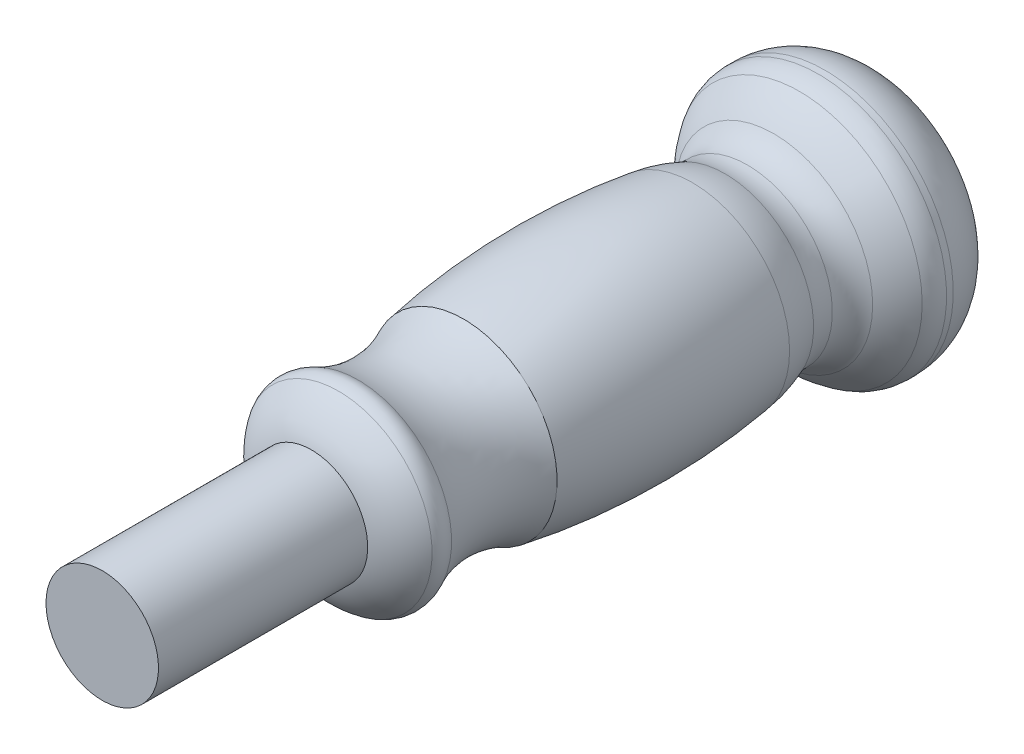
ISO-10303-21;
HEADER;
FILE_DESCRIPTION(('STEP AP214'),'2;1');
FILE_NAME('part.step','',(''),(''),'','','');
FILE_SCHEMA(('AUTOMOTIVE_DESIGN { 1 0 10303 214 1 1 1 1 }'));
ENDSEC;
DATA;
#1=APPLICATION_CONTEXT('core data for automotive mechanical design processes');
#2=APPLICATION_PROTOCOL_DEFINITION('international standard','automotive_design',2000,#1);
#3=PRODUCT_CONTEXT('',#1,'mechanical');
#4=PRODUCT('Part','Part','',(#3));
#5=PRODUCT_RELATED_PRODUCT_CATEGORY('part','',(#4));
#6=PRODUCT_DEFINITION_FORMATION('','',#4);
#7=PRODUCT_DEFINITION_CONTEXT('part definition',#1,'design');
#8=PRODUCT_DEFINITION('design','',#6,#7);
#9=PRODUCT_DEFINITION_SHAPE('','',#8);
#10=(LENGTH_UNIT() NAMED_UNIT(*) SI_UNIT(.MILLI.,.METRE.));
#11=(NAMED_UNIT(*) PLANE_ANGLE_UNIT() SI_UNIT($,.RADIAN.));
#12=(NAMED_UNIT(*) SI_UNIT($,.STERADIAN.) SOLID_ANGLE_UNIT());
#13=UNCERTAINTY_MEASURE_WITH_UNIT(LENGTH_MEASURE(1.E-05),#10,'distance_accuracy_value','');
#14=(GEOMETRIC_REPRESENTATION_CONTEXT(3) GLOBAL_UNCERTAINTY_ASSIGNED_CONTEXT((#13)) GLOBAL_UNIT_ASSIGNED_CONTEXT((#10,
#11,#12)) REPRESENTATION_CONTEXT('',''));
#15=CARTESIAN_POINT('',(0.,0.,0.));
#16=DIRECTION('',(0.,0.,1.));
#17=DIRECTION('',(1.,0.,0.));
#18=AXIS2_PLACEMENT_3D('',#15,#16,#17);
#19=CARTESIAN_POINT('',(0.,0.,-152.4));
#20=DIRECTION('',(0.,0.,-1.));
#21=DIRECTION('',(-1.,0.,0.));
#22=AXIS2_PLACEMENT_3D('',#19,#20,#21);
#23=CYLINDRICAL_SURFACE('',#22,10.922);
#24=CARTESIAN_POINT('',(0.,0.,0.));
#25=DIRECTION('',(0.,0.,-1.));
#26=DIRECTION('',(-1.,0.,0.));
#27=AXIS2_PLACEMENT_3D('',#24,#25,#26);
#28=CIRCLE('',#27,10.922);
#29=CARTESIAN_POINT('',(-10.922,0.,0.));
#30=VERTEX_POINT('',#29);
#31=EDGE_CURVE('E74',#30,#30,#28,.T.);
#32=ORIENTED_EDGE('',*,*,#31,.T.);
#33=EDGE_LOOP('',(#32));
#34=FACE_BOUND('',#33,.T.);
#35=CARTESIAN_POINT('',(0.,0.,-40.64));
#36=DIRECTION('',(0.,0.,-1.));
#37=DIRECTION('',(-1.,0.,0.));
#38=AXIS2_PLACEMENT_3D('',#35,#36,#37);
#39=CIRCLE('',#38,10.922);
#40=CARTESIAN_POINT('',(-10.922,0.,-40.64));
#41=VERTEX_POINT('',#40);
#42=EDGE_CURVE('E10',#41,#41,#39,.T.);
#43=ORIENTED_EDGE('',*,*,#42,.F.);
#44=EDGE_LOOP('',(#43));
#45=FACE_BOUND('',#44,.T.);
#46=ADVANCED_FACE('F31',(#34,#45),#23,.T.);
#47=CARTESIAN_POINT('',(0.,0.,-53.7343067267956));
#48=DIRECTION('',(0.,0.,-1.));
#49=DIRECTION('',(-1.,0.,0.));
#50=AXIS2_PLACEMENT_3D('',#47,#48,#49);
#51=DEGENERATE_TOROIDAL_SURFACE('',#50,6.88592212427021,13.7022185530066,.T.);
#52=ORIENTED_EDGE('',*,*,#42,.T.);
#53=EDGE_LOOP('',(#52));
#54=FACE_BOUND('',#53,.T.);
#55=CARTESIAN_POINT('',(0.,0.,-45.9269732436232));
#56=DIRECTION('',(0.,0.,-1.));
#57=DIRECTION('',(-1.,0.,0.));
#58=AXIS2_PLACEMENT_3D('',#55,#56,#57);
#59=CIRCLE('',#58,18.1463100908056);
#60=CARTESIAN_POINT('',(-18.1463100908056,0.,-45.9269732436232));
#61=VERTEX_POINT('',#60);
#62=EDGE_CURVE('E37',#61,#61,#59,.T.);
#63=ORIENTED_EDGE('',*,*,#62,.F.);
#64=EDGE_LOOP('',(#63));
#65=FACE_BOUND('',#64,.T.);
#66=ADVANCED_FACE('F91',(#54,#65),#51,.T.);
#67=CARTESIAN_POINT('',(0.,0.,-47.8212488907953));
#68=DIRECTION('',(0.,0.,-1.));
#69=DIRECTION('',(-1.,0.,0.));
#70=AXIS2_PLACEMENT_3D('',#67,#68,#69);
#71=TOROIDAL_SURFACE('',#70,15.0438953815722,3.63500443679744);
#72=ORIENTED_EDGE('',*,*,#62,.T.);
#73=EDGE_LOOP('',(#72));
#74=FACE_BOUND('',#73,.T.);
#75=CARTESIAN_POINT('',(0.,0.,-49.7155245379673));
#76=DIRECTION('',(0.,0.,-1.));
#77=DIRECTION('',(-1.,0.,0.));
#78=AXIS2_PLACEMENT_3D('',#75,#76,#77);
#79=CIRCLE('',#78,18.1463100908056);
#80=CARTESIAN_POINT('',(-18.1463100908056,0.,-49.7155245379673));
#81=VERTEX_POINT('',#80);
#82=EDGE_CURVE('E41',#81,#81,#79,.T.);
#83=ORIENTED_EDGE('',*,*,#82,.F.);
#84=EDGE_LOOP('',(#83));
#85=FACE_BOUND('',#84,.T.);
#86=ADVANCED_FACE('F95',(#74,#85),#71,.T.);
#87=CARTESIAN_POINT('',(0.,0.,-59.9575181328046));
#88=DIRECTION('',(0.,0.,-1.));
#89=DIRECTION('',(-1.,0.,0.));
#90=AXIS2_PLACEMENT_3D('',#87,#88,#89);
#91=TOROIDAL_SURFACE('',#90,39.1447821976964,23.3630961907997);
#92=ORIENTED_EDGE('',*,*,#82,.T.);
#93=EDGE_LOOP('',(#92));
#94=FACE_BOUND('',#93,.T.);
#95=CARTESIAN_POINT('',(0.,0.,-70.1995117276419));
#96=DIRECTION('',(0.,0.,-1.));
#97=DIRECTION('',(-1.,0.,0.));
#98=AXIS2_PLACEMENT_3D('',#95,#96,#97);
#99=CIRCLE('',#98,18.1463100908056);
#100=CARTESIAN_POINT('',(-18.1463100908056,0.,-70.1995117276419));
#101=VERTEX_POINT('',#100);
#102=EDGE_CURVE('E45',#101,#101,#99,.T.);
#103=ORIENTED_EDGE('',*,*,#102,.F.);
#104=EDGE_LOOP('',(#103));
#105=FACE_BOUND('',#104,.T.);
#106=ADVANCED_FACE('F99',(#94,#105),#91,.F.);
#107=CARTESIAN_POINT('',(0.,0.,-94.6645510527242));
#108=DIRECTION('',(0.,0.,-1.));
#109=DIRECTION('',(-1.,0.,0.));
#110=AXIS2_PLACEMENT_3D('',#107,#108,#109);
#111=DEGENERATE_TOROIDAL_SURFACE('',#110,123.464948961464,143.709035344153,.F.);
#112=ORIENTED_EDGE('',*,*,#102,.T.);
#113=EDGE_LOOP('',(#112));
#114=FACE_BOUND('',#113,.T.);
#115=CARTESIAN_POINT('',(0.,0.,-114.664007691683));
#116=DIRECTION('',(0.,0.,-1.));
#117=DIRECTION('',(-1.,0.,0.));
#118=AXIS2_PLACEMENT_3D('',#115,#116,#117);
#119=CIRCLE('',#118,18.845657016071);
#120=CARTESIAN_POINT('',(-18.845657016071,0.,-114.664007691683));
#121=VERTEX_POINT('',#120);
#122=EDGE_CURVE('E50',#121,#121,#119,.T.);
#123=ORIENTED_EDGE('',*,*,#122,.F.);
#124=EDGE_LOOP('',(#123));
#125=FACE_BOUND('',#124,.T.);
#126=ADVANCED_FACE('F105',(#114,#125),#111,.F.);
#127=CARTESIAN_POINT('',(0.,0.,-110.793160163222));
#128=DIRECTION('',(0.,0.,-1.));
#129=DIRECTION('',(-1.,0.,0.));
#130=AXIS2_PLACEMENT_3D('',#127,#128,#129);
#131=DEGENERATE_TOROIDAL_SURFACE('',#130,8.69822416862676,27.8145438809509,.F.);
#132=ORIENTED_EDGE('',*,*,#122,.T.);
#133=EDGE_LOOP('',(#132));
#134=FACE_BOUND('',#133,.T.);
#135=CARTESIAN_POINT('',(0.,0.,-120.991679599425));
#136=DIRECTION('',(0.,0.,-1.));
#137=DIRECTION('',(-1.,0.,0.));
#138=AXIS2_PLACEMENT_3D('',#135,#136,#137);
#139=CIRCLE('',#138,17.17916079614);
#140=CARTESIAN_POINT('',(-17.17916079614,0.,-120.991679599425));
#141=VERTEX_POINT('',#140);
#142=EDGE_CURVE('E53',#141,#141,#139,.T.);
#143=ORIENTED_EDGE('',*,*,#142,.F.);
#144=EDGE_LOOP('',(#143));
#145=FACE_BOUND('',#144,.T.);
#146=ADVANCED_FACE('F109',(#134,#145),#131,.F.);
#147=CARTESIAN_POINT('',(0.,0.,-124.710703557818));
#148=DIRECTION('',(0.,0.,-1.));
#149=DIRECTION('',(-1.,0.,0.));
#150=AXIS2_PLACEMENT_3D('',#147,#148,#149);
#151=TOROIDAL_SURFACE('',#150,26.6156888398974,10.1429384659339);
#152=ORIENTED_EDGE('',*,*,#142,.T.);
#153=EDGE_LOOP('',(#152));
#154=FACE_BOUND('',#153,.T.);
#155=CARTESIAN_POINT('',(0.,0.,-125.328837200299));
#156=DIRECTION('',(0.,0.,-1.));
#157=DIRECTION('',(-1.,0.,0.));
#158=AXIS2_PLACEMENT_3D('',#155,#156,#157);
#159=CIRCLE('',#158,16.491603126918);
#160=CARTESIAN_POINT('',(-16.491603126918,0.,-125.328837200299));
#161=VERTEX_POINT('',#160);
#162=EDGE_CURVE('E56',#161,#161,#159,.T.);
#163=ORIENTED_EDGE('',*,*,#162,.F.);
#164=EDGE_LOOP('',(#163));
#165=FACE_BOUND('',#164,.T.);
#166=ADVANCED_FACE('F113',(#154,#165),#151,.F.);
#167=CARTESIAN_POINT('',(0.,0.,-124.903332351948));
#168=DIRECTION('',(0.,0.,-1.));
#169=DIRECTION('',(-1.,0.,0.));
#170=AXIS2_PLACEMENT_3D('',#167,#168,#169);
#171=TOROIDAL_SURFACE('',#170,23.4607231681825,6.98209771669844);
#172=ORIENTED_EDGE('',*,*,#162,.T.);
#173=EDGE_LOOP('',(#172));
#174=FACE_BOUND('',#173,.T.);
#175=CARTESIAN_POINT('',(0.,0.,-130.439683109815));
#176=DIRECTION('',(0.,0.,-1.));
#177=DIRECTION('',(-1.,0.,0.));
#178=AXIS2_PLACEMENT_3D('',#175,#176,#177);
#179=CIRCLE('',#178,19.2064889466812);
#180=CARTESIAN_POINT('',(-19.2064889466812,0.,-130.439683109815));
#181=VERTEX_POINT('',#180);
#182=EDGE_CURVE('E59',#181,#181,#179,.T.);
#183=ORIENTED_EDGE('',*,*,#182,.F.);
#184=EDGE_LOOP('',(#183));
#185=FACE_BOUND('',#184,.T.);
#186=ADVANCED_FACE('F117',(#174,#185),#171,.F.);
#187=CARTESIAN_POINT('',(0.,0.,-146.390686313675));
#188=DIRECTION('',(0.,0.,-1.));
#189=DIRECTION('',(-1.,0.,0.));
#190=AXIS2_PLACEMENT_3D('',#187,#188,#189);
#191=DEGENERATE_TOROIDAL_SURFACE('',#190,6.94944334661404,20.1164030097753,.T.);
#192=ORIENTED_EDGE('',*,*,#182,.T.);
#193=EDGE_LOOP('',(#192));
#194=FACE_BOUND('',#193,.T.);
#195=CARTESIAN_POINT('',(0.,0.,-135.437827897881));
#196=DIRECTION('',(0.,0.,-1.));
#197=DIRECTION('',(-1.,0.,0.));
#198=AXIS2_PLACEMENT_3D('',#195,#196,#197);
#199=CIRCLE('',#198,23.8226339925841);
#200=CARTESIAN_POINT('',(-23.8226339925841,0.,-135.437827897881));
#201=VERTEX_POINT('',#200);
#202=EDGE_CURVE('E62',#201,#201,#199,.T.);
#203=ORIENTED_EDGE('',*,*,#202,.F.);
#204=EDGE_LOOP('',(#203));
#205=FACE_BOUND('',#204,.T.);
#206=ADVANCED_FACE('F121',(#194,#205),#191,.T.);
#207=CARTESIAN_POINT('',(0.,0.,-139.097981176091));
#208=DIRECTION('',(0.,0.,-1.));
#209=DIRECTION('',(-1.,0.,0.));
#210=AXIS2_PLACEMENT_3D('',#207,#208,#209);
#211=TOROIDAL_SURFACE('',#210,18.1840635197235,6.72236558046447);
#212=ORIENTED_EDGE('',*,*,#202,.T.);
#213=EDGE_LOOP('',(#212));
#214=FACE_BOUND('',#213,.T.);
#215=CARTESIAN_POINT('',(0.,0.,-139.097981176091));
#216=DIRECTION('',(0.,0.,-1.));
#217=DIRECTION('',(-1.,0.,0.));
#218=AXIS2_PLACEMENT_3D('',#215,#216,#217);
#219=CIRCLE('',#218,24.9064291001879);
#220=CARTESIAN_POINT('',(-24.9064291001879,0.,-139.097981176091));
#221=VERTEX_POINT('',#220);
#222=EDGE_CURVE('E65',#221,#221,#219,.T.);
#223=ORIENTED_EDGE('',*,*,#222,.F.);
#224=EDGE_LOOP('',(#223));
#225=FACE_BOUND('',#224,.T.);
#226=ADVANCED_FACE('F125',(#214,#225),#211,.T.);
#227=CARTESIAN_POINT('',(0.,0.,-152.4));
#228=DIRECTION('',(0.,0.,-1.));
#229=DIRECTION('',(-1.,0.,0.));
#230=AXIS2_PLACEMENT_3D('',#227,#228,#229);
#231=CYLINDRICAL_SURFACE('',#230,24.9064291001879);
#232=ORIENTED_EDGE('',*,*,#222,.T.);
#233=EDGE_LOOP('',(#232));
#234=FACE_BOUND('',#233,.T.);
#235=CARTESIAN_POINT('',(0.,0.,-140.391952157061));
#236=DIRECTION('',(0.,0.,-1.));
#237=DIRECTION('',(-1.,0.,0.));
#238=AXIS2_PLACEMENT_3D('',#235,#236,#237);
#239=CIRCLE('',#238,24.9064291001879);
#240=CARTESIAN_POINT('',(-24.9064291001879,0.,-140.391952157061));
#241=VERTEX_POINT('',#240);
#242=EDGE_CURVE('E68',#241,#241,#239,.T.);
#243=ORIENTED_EDGE('',*,*,#242,.F.);
#244=EDGE_LOOP('',(#243));
#245=FACE_BOUND('',#244,.T.);
#246=ADVANCED_FACE('F129',(#234,#245),#231,.T.);
#247=CARTESIAN_POINT('',(0.,0.,-139.931833442998));
#248=DIRECTION('',(0.,0.,-1.));
#249=DIRECTION('',(-1.,0.,0.));
#250=AXIS2_PLACEMENT_3D('',#247,#248,#249);
#251=DEGENERATE_TOROIDAL_SURFACE('',#250,12.2105426072603,12.7042214665965,.T.);
#252=ORIENTED_EDGE('',*,*,#242,.T.);
#253=EDGE_LOOP('',(#252));
#254=FACE_BOUND('',#253,.T.);
#255=CARTESIAN_POINT('',(0.,0.,-152.4));
#256=DIRECTION('',(0.,0.,-1.));
#257=DIRECTION('',(-1.,0.,0.));
#258=AXIS2_PLACEMENT_3D('',#255,#256,#257);
#259=CIRCLE('',#258,14.6481778915442);
#260=CARTESIAN_POINT('',(-14.6481778915442,0.,-152.4));
#261=VERTEX_POINT('',#260);
#262=EDGE_CURVE('E71',#261,#261,#259,.T.);
#263=ORIENTED_EDGE('',*,*,#262,.F.);
#264=EDGE_LOOP('',(#263));
#265=FACE_BOUND('',#264,.T.);
#266=ADVANCED_FACE('F87',(#254,#265),#251,.T.);
#267=CARTESIAN_POINT('',(0.,0.,-152.4));
#268=DIRECTION('',(0.,0.,-1.));
#269=DIRECTION('',(-1.,0.,0.));
#270=AXIS2_PLACEMENT_3D('',#267,#268,#269);
#271=PLANE('',#270);
#272=ORIENTED_EDGE('',*,*,#262,.T.);
#273=EDGE_LOOP('',(#272));
#274=FACE_BOUND('',#273,.T.);
#275=ADVANCED_FACE('F82',(#274),#271,.T.);
#276=CARTESIAN_POINT('',(-10.922,0.,0.));
#277=DIRECTION('',(0.,0.,1.));
#278=DIRECTION('',(1.,0.,0.));
#279=AXIS2_PLACEMENT_3D('',#276,#277,#278);
#280=PLANE('',#279);
#281=ORIENTED_EDGE('',*,*,#31,.F.);
#282=EDGE_LOOP('',(#281));
#283=FACE_BOUND('',#282,.T.);
#284=ADVANCED_FACE('F80',(#283),#280,.T.);
#285=CLOSED_SHELL('',(#46,#66,#86,#106,#126,#146,#166,#186,#206,#226,#246,#266,#275,#284));
#286=MANIFOLD_SOLID_BREP('B2',#285);
#287=ADVANCED_BREP_SHAPE_REPRESENTATION('',(#18,#286),#14);
#288=SHAPE_DEFINITION_REPRESENTATION(#9,#287);
ENDSEC;
END-ISO-10303-21;
